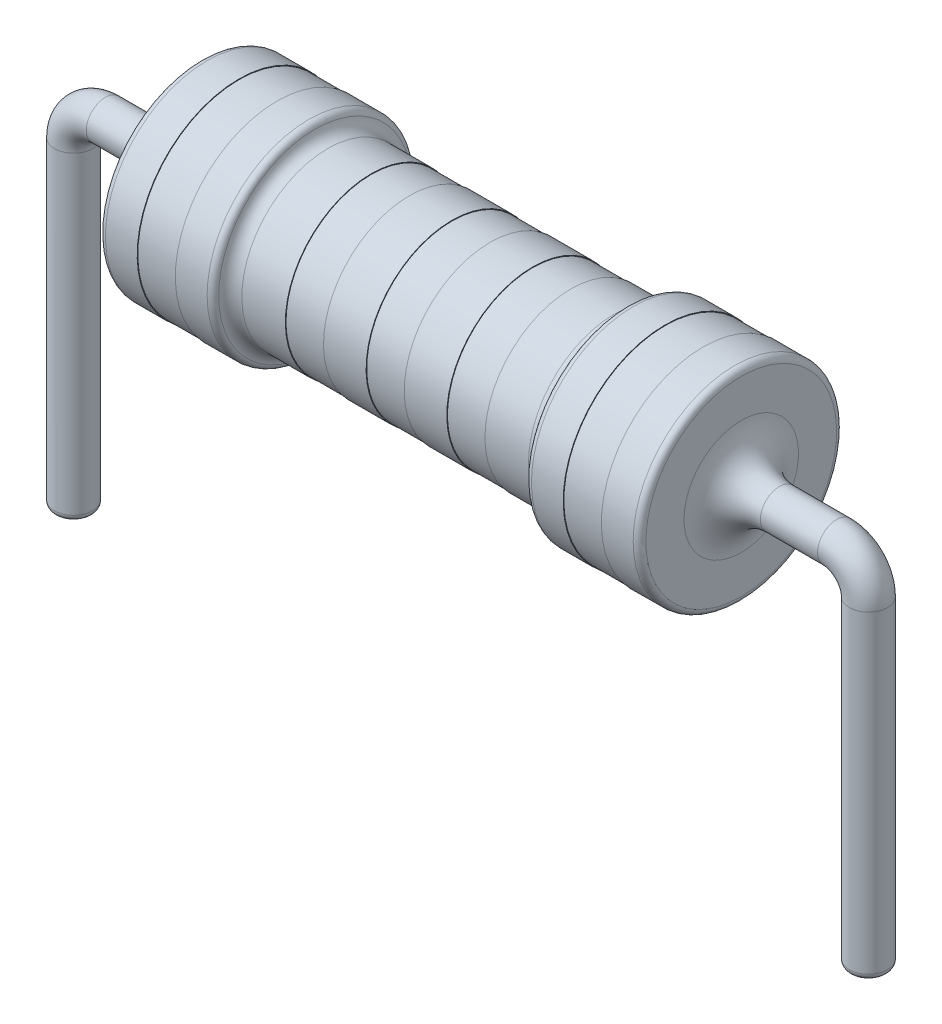
ISO-10303-21;
HEADER;
FILE_DESCRIPTION(('STEP AP214'),'2;1');
FILE_NAME('part.step','',(''),(''),'','','');
FILE_SCHEMA(('AUTOMOTIVE_DESIGN { 1 0 10303 214 1 1 1 1 }'));
ENDSEC;
DATA;
#1=APPLICATION_CONTEXT('core data for automotive mechanical design processes');
#2=APPLICATION_PROTOCOL_DEFINITION('international standard','automotive_design',2000,#1);
#3=PRODUCT_CONTEXT('',#1,'mechanical');
#4=PRODUCT('Part','Part','',(#3));
#5=PRODUCT_RELATED_PRODUCT_CATEGORY('part','',(#4));
#6=PRODUCT_DEFINITION_FORMATION('','',#4);
#7=PRODUCT_DEFINITION_CONTEXT('part definition',#1,'design');
#8=PRODUCT_DEFINITION('design','',#6,#7);
#9=PRODUCT_DEFINITION_SHAPE('','',#8);
#10=(LENGTH_UNIT() NAMED_UNIT(*) SI_UNIT(.MILLI.,.METRE.));
#11=(NAMED_UNIT(*) PLANE_ANGLE_UNIT() SI_UNIT($,.RADIAN.));
#12=(NAMED_UNIT(*) SI_UNIT($,.STERADIAN.) SOLID_ANGLE_UNIT());
#13=UNCERTAINTY_MEASURE_WITH_UNIT(LENGTH_MEASURE(1.E-05),#10,'distance_accuracy_value','');
#14=(GEOMETRIC_REPRESENTATION_CONTEXT(3) GLOBAL_UNCERTAINTY_ASSIGNED_CONTEXT((#13)) GLOBAL_UNIT_ASSIGNED_CONTEXT((#10,
#11,#12)) REPRESENTATION_CONTEXT('',''));
#15=CARTESIAN_POINT('',(0.,0.,0.));
#16=DIRECTION('',(0.,0.,1.));
#17=DIRECTION('',(1.,0.,0.));
#18=AXIS2_PLACEMENT_3D('',#15,#16,#17);
#19=CARTESIAN_POINT('',(4.25,0.,0.));
#20=DIRECTION('',(-1.,0.,0.));
#21=DIRECTION('',(0.,-1.,0.));
#22=AXIS2_PLACEMENT_3D('',#19,#20,#21);
#23=PLANE('',#22);
#24=CARTESIAN_POINT('',(4.25,0.,0.));
#25=DIRECTION('',(-1.,0.,0.));
#26=DIRECTION('',(0.,-1.,0.));
#27=AXIS2_PLACEMENT_3D('',#24,#25,#26);
#28=CIRCLE('',#27,0.9);
#29=CARTESIAN_POINT('',(4.25,-0.899999999999984,0.));
#30=VERTEX_POINT('',#29);
#31=EDGE_CURVE('E54',#30,#30,#28,.T.);
#32=ORIENTED_EDGE('',*,*,#31,.T.);
#33=EDGE_LOOP('',(#32));
#34=FACE_BOUND('',#33,.T.);
#35=CARTESIAN_POINT('',(4.25,0.,0.));
#36=DIRECTION('',(-1.,0.,0.));
#37=DIRECTION('',(0.,-1.,0.));
#38=AXIS2_PLACEMENT_3D('',#35,#36,#37);
#39=CIRCLE('',#38,1.5);
#40=CARTESIAN_POINT('',(4.25000000000001,-1.5,0.));
#41=VERTEX_POINT('',#40);
#42=EDGE_CURVE('E87',#41,#41,#39,.F.);
#43=ORIENTED_EDGE('',*,*,#42,.T.);
#44=EDGE_LOOP('',(#43));
#45=FACE_BOUND('',#44,.T.);
#46=ADVANCED_FACE('F34',(#34,#45),#23,.F.);
#47=CARTESIAN_POINT('',(4.25,0.,0.));
#48=DIRECTION('',(1.,0.,0.));
#49=DIRECTION('',(0.,1.,0.));
#50=AXIS2_PLACEMENT_3D('',#47,#48,#49);
#51=CYLINDRICAL_SURFACE('',#50,1.33999999999997);
#52=CARTESIAN_POINT('',(0.299999999999991,0.,0.));
#53=DIRECTION('',(1.,0.,0.));
#54=DIRECTION('',(0.,1.,0.));
#55=AXIS2_PLACEMENT_3D('',#52,#53,#54);
#56=CIRCLE('',#55,1.33999999999997);
#57=CARTESIAN_POINT('',(0.299999999999982,1.33999999999995,0.));
#58=VERTEX_POINT('',#57);
#59=EDGE_CURVE('E153',#58,#58,#56,.T.);
#60=ORIENTED_EDGE('',*,*,#59,.F.);
#61=EDGE_LOOP('',(#60));
#62=FACE_BOUND('',#61,.T.);
#63=CARTESIAN_POINT('',(-0.299999999999991,0.,0.));
#64=DIRECTION('',(1.,0.,0.));
#65=DIRECTION('',(0.,1.,0.));
#66=AXIS2_PLACEMENT_3D('',#63,#64,#65);
#67=CIRCLE('',#66,1.33999999999997);
#68=CARTESIAN_POINT('',(-0.3,1.33999999999994,0.));
#69=VERTEX_POINT('',#68);
#70=EDGE_CURVE('E96',#69,#69,#67,.T.);
#71=ORIENTED_EDGE('',*,*,#70,.T.);
#72=EDGE_LOOP('',(#71));
#73=FACE_BOUND('',#72,.T.);
#74=ADVANCED_FACE('F188',(#62,#73),#51,.T.);
#75=CARTESIAN_POINT('',(-0.299999999999982,-1.34,0.));
#76=DIRECTION('',(-1.,0.,0.));
#77=DIRECTION('',(0.,-1.,0.));
#78=AXIS2_PLACEMENT_3D('',#75,#76,#77);
#79=PLANE('',#78);
#80=ORIENTED_EDGE('',*,*,#70,.F.);
#81=EDGE_LOOP('',(#80));
#82=FACE_BOUND('',#81,.T.);
#83=CARTESIAN_POINT('',(-0.299999999999991,0.,0.));
#84=DIRECTION('',(1.,0.,0.));
#85=DIRECTION('',(0.,1.,0.));
#86=AXIS2_PLACEMENT_3D('',#83,#84,#85);
#87=CIRCLE('',#86,1.34999999999997);
#88=CARTESIAN_POINT('',(-0.3,1.34999999999994,0.));
#89=VERTEX_POINT('',#88);
#90=EDGE_CURVE('E99',#89,#89,#87,.T.);
#91=ORIENTED_EDGE('',*,*,#90,.T.);
#92=EDGE_LOOP('',(#91));
#93=FACE_BOUND('',#92,.T.);
#94=ADVANCED_FACE('F194',(#82,#93),#79,.F.);
#95=CARTESIAN_POINT('',(4.25,0.,0.));
#96=DIRECTION('',(1.,0.,0.));
#97=DIRECTION('',(0.,1.,0.));
#98=AXIS2_PLACEMENT_3D('',#95,#96,#97);
#99=CYLINDRICAL_SURFACE('',#98,1.34999999999998);
#100=ORIENTED_EDGE('',*,*,#90,.F.);
#101=EDGE_LOOP('',(#100));
#102=FACE_BOUND('',#101,.T.);
#103=CARTESIAN_POINT('',(-0.969520407326291,0.,0.));
#104=DIRECTION('',(1.,0.,0.));
#105=DIRECTION('',(0.,1.,0.));
#106=AXIS2_PLACEMENT_3D('',#103,#104,#105);
#107=CIRCLE('',#106,1.34999999999998);
#108=CARTESIAN_POINT('',(-0.9695204073263,1.34999999999994,0.));
#109=VERTEX_POINT('',#108);
#110=EDGE_CURVE('E102',#109,#109,#107,.T.);
#111=ORIENTED_EDGE('',*,*,#110,.T.);
#112=EDGE_LOOP('',(#111));
#113=FACE_BOUND('',#112,.T.);
#114=ADVANCED_FACE('F241',(#102,#113),#99,.T.);
#115=CARTESIAN_POINT('',(-0.969520407326283,-1.34000000000001,0.));
#116=DIRECTION('',(1.,0.,0.));
#117=DIRECTION('',(0.,1.,0.));
#118=AXIS2_PLACEMENT_3D('',#115,#116,#117);
#119=PLANE('',#118);
#120=ORIENTED_EDGE('',*,*,#110,.F.);
#121=EDGE_LOOP('',(#120));
#122=FACE_BOUND('',#121,.T.);
#123=CARTESIAN_POINT('',(-0.969520407326291,0.,0.));
#124=DIRECTION('',(1.,0.,0.));
#125=DIRECTION('',(0.,1.,0.));
#126=AXIS2_PLACEMENT_3D('',#123,#124,#125);
#127=CIRCLE('',#126,1.33999999999998);
#128=CARTESIAN_POINT('',(-0.9695204073263,1.33999999999994,0.));
#129=VERTEX_POINT('',#128);
#130=EDGE_CURVE('E105',#129,#129,#127,.T.);
#131=ORIENTED_EDGE('',*,*,#130,.T.);
#132=EDGE_LOOP('',(#131));
#133=FACE_BOUND('',#132,.T.);
#134=ADVANCED_FACE('F237',(#122,#133),#119,.F.);
#135=CARTESIAN_POINT('',(4.25,0.,0.));
#136=DIRECTION('',(1.,0.,0.));
#137=DIRECTION('',(0.,1.,0.));
#138=AXIS2_PLACEMENT_3D('',#135,#136,#137);
#139=CYLINDRICAL_SURFACE('',#138,1.33999999999998);
#140=ORIENTED_EDGE('',*,*,#130,.F.);
#141=EDGE_LOOP('',(#140));
#142=FACE_BOUND('',#141,.T.);
#143=CARTESIAN_POINT('',(-1.56952040732629,0.,0.));
#144=DIRECTION('',(1.,0.,0.));
#145=DIRECTION('',(0.,1.,0.));
#146=AXIS2_PLACEMENT_3D('',#143,#144,#145);
#147=CIRCLE('',#146,1.33999999999998);
#148=CARTESIAN_POINT('',(-1.5695204073263,1.33999999999994,0.));
#149=VERTEX_POINT('',#148);
#150=EDGE_CURVE('E108',#149,#149,#147,.T.);
#151=ORIENTED_EDGE('',*,*,#150,.T.);
#152=EDGE_LOOP('',(#151));
#153=FACE_BOUND('',#152,.T.);
#154=ADVANCED_FACE('F233',(#142,#153),#139,.T.);
#155=CARTESIAN_POINT('',(-1.56952040732628,-1.35000000000002,0.));
#156=DIRECTION('',(-1.,0.,0.));
#157=DIRECTION('',(0.,-1.,0.));
#158=AXIS2_PLACEMENT_3D('',#155,#156,#157);
#159=PLANE('',#158);
#160=ORIENTED_EDGE('',*,*,#150,.F.);
#161=EDGE_LOOP('',(#160));
#162=FACE_BOUND('',#161,.T.);
#163=CARTESIAN_POINT('',(-1.56952040732629,0.,0.));
#164=DIRECTION('',(1.,0.,0.));
#165=DIRECTION('',(0.,1.,0.));
#166=AXIS2_PLACEMENT_3D('',#163,#164,#165);
#167=CIRCLE('',#166,1.34999999999998);
#168=CARTESIAN_POINT('',(-1.5695204073263,1.34999999999994,0.));
#169=VERTEX_POINT('',#168);
#170=EDGE_CURVE('E111',#169,#169,#167,.T.);
#171=ORIENTED_EDGE('',*,*,#170,.T.);
#172=EDGE_LOOP('',(#171));
#173=FACE_BOUND('',#172,.T.);
#174=ADVANCED_FACE('F229',(#162,#173),#159,.F.);
#175=CARTESIAN_POINT('',(4.25,0.,0.));
#176=DIRECTION('',(1.,0.,0.));
#177=DIRECTION('',(0.,1.,0.));
#178=AXIS2_PLACEMENT_3D('',#175,#176,#177);
#179=CYLINDRICAL_SURFACE('',#178,1.34999999999999);
#180=CARTESIAN_POINT('',(-2.25419601084501,0.,0.));
#181=DIRECTION('',(1.,0.,0.));
#182=DIRECTION('',(0.,1.,0.));
#183=AXIS2_PLACEMENT_3D('',#180,#181,#182);
#184=CIRCLE('',#183,1.34999999999999);
#185=CARTESIAN_POINT('',(-2.25419601084502,1.34999999999994,0.));
#186=VERTEX_POINT('',#185);
#187=EDGE_CURVE('E69',#186,#186,#184,.T.);
#188=ORIENTED_EDGE('',*,*,#187,.T.);
#189=EDGE_LOOP('',(#188));
#190=FACE_BOUND('',#189,.T.);
#191=ORIENTED_EDGE('',*,*,#170,.F.);
#192=EDGE_LOOP('',(#191));
#193=FACE_BOUND('',#192,.T.);
#194=ADVANCED_FACE('F225',(#190,#193),#179,.T.);
#195=CARTESIAN_POINT('',(4.25,0.,0.));
#196=DIRECTION('',(1.,0.,0.));
#197=DIRECTION('',(0.,1.,0.));
#198=AXIS2_PLACEMENT_3D('',#195,#196,#197);
#199=CYLINDRICAL_SURFACE('',#198,1.59999999999999);
#200=CARTESIAN_POINT('',(-2.54999999999999,0.,0.));
#201=DIRECTION('',(-1.,0.,0.));
#202=DIRECTION('',(0.,-1.,0.));
#203=AXIS2_PLACEMENT_3D('',#200,#201,#202);
#204=CIRCLE('',#203,1.59999999999999);
#205=CARTESIAN_POINT('',(-2.54999999999998,-1.60000000000003,0.));
#206=VERTEX_POINT('',#205);
#207=EDGE_CURVE('E90',#206,#206,#204,.T.);
#208=ORIENTED_EDGE('',*,*,#207,.T.);
#209=EDGE_LOOP('',(#208));
#210=FACE_BOUND('',#209,.T.);
#211=CARTESIAN_POINT('',(-3.04999999999999,0.,0.));
#212=DIRECTION('',(1.,0.,0.));
#213=DIRECTION('',(0.,1.,0.));
#214=AXIS2_PLACEMENT_3D('',#211,#212,#213);
#215=CIRCLE('',#214,1.59999999999999);
#216=CARTESIAN_POINT('',(-3.05,1.59999999999994,0.));
#217=VERTEX_POINT('',#216);
#218=EDGE_CURVE('E114',#217,#217,#215,.T.);
#219=ORIENTED_EDGE('',*,*,#218,.T.);
#220=EDGE_LOOP('',(#219));
#221=FACE_BOUND('',#220,.T.);
#222=ADVANCED_FACE('F221',(#210,#221),#199,.T.);
#223=CARTESIAN_POINT('',(-3.04999999999998,-1.59000000000004,0.));
#224=DIRECTION('',(1.,0.,0.));
#225=DIRECTION('',(0.,1.,0.));
#226=AXIS2_PLACEMENT_3D('',#223,#224,#225);
#227=PLANE('',#226);
#228=ORIENTED_EDGE('',*,*,#218,.F.);
#229=EDGE_LOOP('',(#228));
#230=FACE_BOUND('',#229,.T.);
#231=CARTESIAN_POINT('',(-3.04999999999999,0.,0.));
#232=DIRECTION('',(1.,0.,0.));
#233=DIRECTION('',(0.,1.,0.));
#234=AXIS2_PLACEMENT_3D('',#231,#232,#233);
#235=CIRCLE('',#234,1.58999999999999);
#236=CARTESIAN_POINT('',(-3.05,1.58999999999994,0.));
#237=VERTEX_POINT('',#236);
#238=EDGE_CURVE('E117',#237,#237,#235,.T.);
#239=ORIENTED_EDGE('',*,*,#238,.T.);
#240=EDGE_LOOP('',(#239));
#241=FACE_BOUND('',#240,.T.);
#242=ADVANCED_FACE('F217',(#230,#241),#227,.F.);
#243=CARTESIAN_POINT('',(4.25,0.,0.));
#244=DIRECTION('',(1.,0.,0.));
#245=DIRECTION('',(0.,1.,0.));
#246=AXIS2_PLACEMENT_3D('',#243,#244,#245);
#247=CYLINDRICAL_SURFACE('',#246,1.58999999999999);
#248=ORIENTED_EDGE('',*,*,#238,.F.);
#249=EDGE_LOOP('',(#248));
#250=FACE_BOUND('',#249,.T.);
#251=CARTESIAN_POINT('',(-3.64999999999999,0.,0.));
#252=DIRECTION('',(1.,0.,0.));
#253=DIRECTION('',(0.,1.,0.));
#254=AXIS2_PLACEMENT_3D('',#251,#252,#253);
#255=CIRCLE('',#254,1.59);
#256=CARTESIAN_POINT('',(-3.65,1.58999999999994,0.));
#257=VERTEX_POINT('',#256);
#258=EDGE_CURVE('E120',#257,#257,#255,.T.);
#259=ORIENTED_EDGE('',*,*,#258,.T.);
#260=EDGE_LOOP('',(#259));
#261=FACE_BOUND('',#260,.T.);
#262=ADVANCED_FACE('F213',(#250,#261),#247,.T.);
#263=CARTESIAN_POINT('',(-3.64999999999998,-1.60000000000005,0.));
#264=DIRECTION('',(-1.,0.,0.));
#265=DIRECTION('',(0.,-1.,0.));
#266=AXIS2_PLACEMENT_3D('',#263,#264,#265);
#267=PLANE('',#266);
#268=ORIENTED_EDGE('',*,*,#258,.F.);
#269=EDGE_LOOP('',(#268));
#270=FACE_BOUND('',#269,.T.);
#271=CARTESIAN_POINT('',(-3.64999999999999,0.,0.));
#272=DIRECTION('',(1.,0.,0.));
#273=DIRECTION('',(0.,1.,0.));
#274=AXIS2_PLACEMENT_3D('',#271,#272,#273);
#275=CIRCLE('',#274,1.6);
#276=CARTESIAN_POINT('',(-3.65,1.59999999999994,0.));
#277=VERTEX_POINT('',#276);
#278=EDGE_CURVE('E123',#277,#277,#275,.T.);
#279=ORIENTED_EDGE('',*,*,#278,.T.);
#280=EDGE_LOOP('',(#279));
#281=FACE_BOUND('',#280,.T.);
#282=ADVANCED_FACE('F209',(#270,#281),#267,.F.);
#283=CARTESIAN_POINT('',(4.25,0.,0.));
#284=DIRECTION('',(1.,0.,0.));
#285=DIRECTION('',(0.,1.,0.));
#286=AXIS2_PLACEMENT_3D('',#283,#284,#285);
#287=CYLINDRICAL_SURFACE('',#286,1.6);
#288=CARTESIAN_POINT('',(-4.15,0.,0.));
#289=DIRECTION('',(1.,0.,0.));
#290=DIRECTION('',(0.,1.,0.));
#291=AXIS2_PLACEMENT_3D('',#288,#289,#290);
#292=CIRCLE('',#291,1.6);
#293=CARTESIAN_POINT('',(-4.15000000000001,1.59999999999994,0.));
#294=VERTEX_POINT('',#293);
#295=EDGE_CURVE('E81',#294,#294,#292,.T.);
#296=ORIENTED_EDGE('',*,*,#295,.T.);
#297=EDGE_LOOP('',(#296));
#298=FACE_BOUND('',#297,.T.);
#299=ORIENTED_EDGE('',*,*,#278,.F.);
#300=EDGE_LOOP('',(#299));
#301=FACE_BOUND('',#300,.T.);
#302=ADVANCED_FACE('F205',(#298,#301),#287,.T.);
#303=CARTESIAN_POINT('',(-4.25,0.,0.));
#304=DIRECTION('',(1.,0.,0.));
#305=DIRECTION('',(0.,1.,0.));
#306=AXIS2_PLACEMENT_3D('',#303,#304,#305);
#307=PLANE('',#306);
#308=CARTESIAN_POINT('',(-4.25,0.,0.));
#309=DIRECTION('',(1.,0.,0.));
#310=DIRECTION('',(0.,1.,0.));
#311=AXIS2_PLACEMENT_3D('',#308,#309,#310);
#312=CIRCLE('',#311,0.9);
#313=CARTESIAN_POINT('',(-4.25,0.900000000000023,0.));
#314=VERTEX_POINT('',#313);
#315=EDGE_CURVE('E63',#314,#314,#312,.T.);
#316=ORIENTED_EDGE('',*,*,#315,.T.);
#317=EDGE_LOOP('',(#316));
#318=FACE_BOUND('',#317,.T.);
#319=CARTESIAN_POINT('',(-4.25,0.,0.));
#320=DIRECTION('',(1.,0.,0.));
#321=DIRECTION('',(0.,1.,0.));
#322=AXIS2_PLACEMENT_3D('',#319,#320,#321);
#323=CIRCLE('',#322,1.5);
#324=CARTESIAN_POINT('',(-4.25000000000001,1.49999999999994,0.));
#325=VERTEX_POINT('',#324);
#326=EDGE_CURVE('E78',#325,#325,#323,.F.);
#327=ORIENTED_EDGE('',*,*,#326,.T.);
#328=EDGE_LOOP('',(#327));
#329=FACE_BOUND('',#328,.T.);
#330=ADVANCED_FACE('F202',(#318,#329),#307,.F.);
#331=CARTESIAN_POINT('',(4.25,0.,0.));
#332=DIRECTION('',(1.,0.,0.));
#333=DIRECTION('',(0.,1.,0.));
#334=AXIS2_PLACEMENT_3D('',#331,#332,#333);
#335=CYLINDRICAL_SURFACE('',#334,1.6);
#336=CARTESIAN_POINT('',(4.15,0.,0.));
#337=DIRECTION('',(-1.,0.,0.));
#338=DIRECTION('',(0.,-1.,0.));
#339=AXIS2_PLACEMENT_3D('',#336,#337,#338);
#340=CIRCLE('',#339,1.6);
#341=CARTESIAN_POINT('',(4.15000000000001,-1.6,0.));
#342=VERTEX_POINT('',#341);
#343=EDGE_CURVE('E84',#342,#342,#340,.T.);
#344=ORIENTED_EDGE('',*,*,#343,.T.);
#345=EDGE_LOOP('',(#344));
#346=FACE_BOUND('',#345,.T.);
#347=CARTESIAN_POINT('',(3.64999999999999,0.,0.));
#348=DIRECTION('',(1.,0.,0.));
#349=DIRECTION('',(0.,1.,0.));
#350=AXIS2_PLACEMENT_3D('',#347,#348,#349);
#351=CIRCLE('',#350,1.6);
#352=CARTESIAN_POINT('',(3.64999999999998,1.59999999999999,0.));
#353=VERTEX_POINT('',#352);
#354=EDGE_CURVE('E126',#353,#353,#351,.T.);
#355=ORIENTED_EDGE('',*,*,#354,.T.);
#356=EDGE_LOOP('',(#355));
#357=FACE_BOUND('',#356,.T.);
#358=ADVANCED_FACE('F200',(#346,#357),#335,.T.);
#359=CARTESIAN_POINT('',(3.65,-1.6,0.));
#360=DIRECTION('',(1.,0.,0.));
#361=DIRECTION('',(0.,1.,0.));
#362=AXIS2_PLACEMENT_3D('',#359,#360,#361);
#363=PLANE('',#362);
#364=ORIENTED_EDGE('',*,*,#354,.F.);
#365=EDGE_LOOP('',(#364));
#366=FACE_BOUND('',#365,.T.);
#367=CARTESIAN_POINT('',(3.64999999999999,0.,0.));
#368=DIRECTION('',(1.,0.,0.));
#369=DIRECTION('',(0.,1.,0.));
#370=AXIS2_PLACEMENT_3D('',#367,#368,#369);
#371=CIRCLE('',#370,1.59);
#372=CARTESIAN_POINT('',(3.64999999999998,1.58999999999999,0.));
#373=VERTEX_POINT('',#372);
#374=EDGE_CURVE('E129',#373,#373,#371,.T.);
#375=ORIENTED_EDGE('',*,*,#374,.T.);
#376=EDGE_LOOP('',(#375));
#377=FACE_BOUND('',#376,.T.);
#378=ADVANCED_FACE('F342',(#366,#377),#363,.F.);
#379=CARTESIAN_POINT('',(4.25,0.,0.));
#380=DIRECTION('',(1.,0.,0.));
#381=DIRECTION('',(0.,1.,0.));
#382=AXIS2_PLACEMENT_3D('',#379,#380,#381);
#383=CYLINDRICAL_SURFACE('',#382,1.58999999999999);
#384=ORIENTED_EDGE('',*,*,#374,.F.);
#385=EDGE_LOOP('',(#384));
#386=FACE_BOUND('',#385,.T.);
#387=CARTESIAN_POINT('',(3.04999999999999,0.,0.));
#388=DIRECTION('',(1.,0.,0.));
#389=DIRECTION('',(0.,1.,0.));
#390=AXIS2_PLACEMENT_3D('',#387,#388,#389);
#391=CIRCLE('',#390,1.58999999999999);
#392=CARTESIAN_POINT('',(3.04999999999998,1.58999999999998,0.));
#393=VERTEX_POINT('',#392);
#394=EDGE_CURVE('E132',#393,#393,#391,.T.);
#395=ORIENTED_EDGE('',*,*,#394,.T.);
#396=EDGE_LOOP('',(#395));
#397=FACE_BOUND('',#396,.T.);
#398=ADVANCED_FACE('F339',(#386,#397),#383,.T.);
#399=CARTESIAN_POINT('',(3.05,-1.59,0.));
#400=DIRECTION('',(-1.,0.,0.));
#401=DIRECTION('',(0.,-1.,0.));
#402=AXIS2_PLACEMENT_3D('',#399,#400,#401);
#403=PLANE('',#402);
#404=ORIENTED_EDGE('',*,*,#394,.F.);
#405=EDGE_LOOP('',(#404));
#406=FACE_BOUND('',#405,.T.);
#407=CARTESIAN_POINT('',(3.04999999999999,0.,0.));
#408=DIRECTION('',(1.,0.,0.));
#409=DIRECTION('',(0.,1.,0.));
#410=AXIS2_PLACEMENT_3D('',#407,#408,#409);
#411=CIRCLE('',#410,1.59999999999999);
#412=CARTESIAN_POINT('',(3.04999999999998,1.59999999999999,0.));
#413=VERTEX_POINT('',#412);
#414=EDGE_CURVE('E135',#413,#413,#411,.T.);
#415=ORIENTED_EDGE('',*,*,#414,.T.);
#416=EDGE_LOOP('',(#415));
#417=FACE_BOUND('',#416,.T.);
#418=ADVANCED_FACE('F335',(#406,#417),#403,.F.);
#419=CARTESIAN_POINT('',(4.25,0.,0.));
#420=DIRECTION('',(1.,0.,0.));
#421=DIRECTION('',(0.,1.,0.));
#422=AXIS2_PLACEMENT_3D('',#419,#420,#421);
#423=CYLINDRICAL_SURFACE('',#422,1.59999999999999);
#424=CARTESIAN_POINT('',(2.54999999999999,0.,0.));
#425=DIRECTION('',(1.,0.,0.));
#426=DIRECTION('',(0.,1.,0.));
#427=AXIS2_PLACEMENT_3D('',#424,#425,#426);
#428=CIRCLE('',#427,1.59999999999999);
#429=CARTESIAN_POINT('',(2.54999999999998,1.59999999999998,0.));
#430=VERTEX_POINT('',#429);
#431=EDGE_CURVE('E93',#430,#430,#428,.T.);
#432=ORIENTED_EDGE('',*,*,#431,.T.);
#433=EDGE_LOOP('',(#432));
#434=FACE_BOUND('',#433,.T.);
#435=ORIENTED_EDGE('',*,*,#414,.F.);
#436=EDGE_LOOP('',(#435));
#437=FACE_BOUND('',#436,.T.);
#438=ADVANCED_FACE('F331',(#434,#437),#423,.T.);
#439=CARTESIAN_POINT('',(4.25,0.,0.));
#440=DIRECTION('',(1.,0.,0.));
#441=DIRECTION('',(0.,1.,0.));
#442=AXIS2_PLACEMENT_3D('',#439,#440,#441);
#443=CYLINDRICAL_SURFACE('',#442,1.34999999999999);
#444=CARTESIAN_POINT('',(2.25419601084501,0.,0.));
#445=DIRECTION('',(1.,0.,0.));
#446=DIRECTION('',(0.,1.,0.));
#447=AXIS2_PLACEMENT_3D('',#444,#445,#446);
#448=CIRCLE('',#447,1.34999999999999);
#449=CARTESIAN_POINT('',(2.254196010845,1.34999999999997,0.));
#450=VERTEX_POINT('',#449);
#451=EDGE_CURVE('E72',#450,#450,#448,.F.);
#452=ORIENTED_EDGE('',*,*,#451,.T.);
#453=EDGE_LOOP('',(#452));
#454=FACE_BOUND('',#453,.T.);
#455=CARTESIAN_POINT('',(1.56952040732629,0.,0.));
#456=DIRECTION('',(1.,0.,0.));
#457=DIRECTION('',(0.,1.,0.));
#458=AXIS2_PLACEMENT_3D('',#455,#456,#457);
#459=CIRCLE('',#458,1.34999999999998);
#460=CARTESIAN_POINT('',(1.56952040732628,1.34999999999997,0.));
#461=VERTEX_POINT('',#460);
#462=EDGE_CURVE('E138',#461,#461,#459,.T.);
#463=ORIENTED_EDGE('',*,*,#462,.T.);
#464=EDGE_LOOP('',(#463));
#465=FACE_BOUND('',#464,.T.);
#466=ADVANCED_FACE('F327',(#454,#465),#443,.T.);
#467=CARTESIAN_POINT('',(1.5695204073263,-1.35,0.));
#468=DIRECTION('',(1.,0.,0.));
#469=DIRECTION('',(0.,1.,0.));
#470=AXIS2_PLACEMENT_3D('',#467,#468,#469);
#471=PLANE('',#470);
#472=ORIENTED_EDGE('',*,*,#462,.F.);
#473=EDGE_LOOP('',(#472));
#474=FACE_BOUND('',#473,.T.);
#475=CARTESIAN_POINT('',(1.56952040732629,0.,0.));
#476=DIRECTION('',(1.,0.,0.));
#477=DIRECTION('',(0.,1.,0.));
#478=AXIS2_PLACEMENT_3D('',#475,#476,#477);
#479=CIRCLE('',#478,1.33999999999998);
#480=CARTESIAN_POINT('',(1.56952040732628,1.33999999999996,0.));
#481=VERTEX_POINT('',#480);
#482=EDGE_CURVE('E141',#481,#481,#479,.T.);
#483=ORIENTED_EDGE('',*,*,#482,.T.);
#484=EDGE_LOOP('',(#483));
#485=FACE_BOUND('',#484,.T.);
#486=ADVANCED_FACE('F323',(#474,#485),#471,.F.);
#487=CARTESIAN_POINT('',(4.25,0.,0.));
#488=DIRECTION('',(1.,0.,0.));
#489=DIRECTION('',(0.,1.,0.));
#490=AXIS2_PLACEMENT_3D('',#487,#488,#489);
#491=CYLINDRICAL_SURFACE('',#490,1.33999999999998);
#492=ORIENTED_EDGE('',*,*,#482,.F.);
#493=EDGE_LOOP('',(#492));
#494=FACE_BOUND('',#493,.T.);
#495=CARTESIAN_POINT('',(0.969520407326292,0.,0.));
#496=DIRECTION('',(1.,0.,0.));
#497=DIRECTION('',(0.,1.,0.));
#498=AXIS2_PLACEMENT_3D('',#495,#496,#497);
#499=CIRCLE('',#498,1.33999999999998);
#500=CARTESIAN_POINT('',(0.969520407326283,1.33999999999996,0.));
#501=VERTEX_POINT('',#500);
#502=EDGE_CURVE('E144',#501,#501,#499,.T.);
#503=ORIENTED_EDGE('',*,*,#502,.T.);
#504=EDGE_LOOP('',(#503));
#505=FACE_BOUND('',#504,.T.);
#506=ADVANCED_FACE('F319',(#494,#505),#491,.T.);
#507=CARTESIAN_POINT('',(0.969520407326301,-1.34,0.));
#508=DIRECTION('',(-1.,0.,0.));
#509=DIRECTION('',(0.,-1.,0.));
#510=AXIS2_PLACEMENT_3D('',#507,#508,#509);
#511=PLANE('',#510);
#512=ORIENTED_EDGE('',*,*,#502,.F.);
#513=EDGE_LOOP('',(#512));
#514=FACE_BOUND('',#513,.T.);
#515=CARTESIAN_POINT('',(0.969520407326291,0.,0.));
#516=DIRECTION('',(1.,0.,0.));
#517=DIRECTION('',(0.,1.,0.));
#518=AXIS2_PLACEMENT_3D('',#515,#516,#517);
#519=CIRCLE('',#518,1.34999999999998);
#520=CARTESIAN_POINT('',(0.969520407326283,1.34999999999996,0.));
#521=VERTEX_POINT('',#520);
#522=EDGE_CURVE('E147',#521,#521,#519,.T.);
#523=ORIENTED_EDGE('',*,*,#522,.T.);
#524=EDGE_LOOP('',(#523));
#525=FACE_BOUND('',#524,.T.);
#526=ADVANCED_FACE('F315',(#514,#525),#511,.F.);
#527=CARTESIAN_POINT('',(4.25,0.,0.));
#528=DIRECTION('',(1.,0.,0.));
#529=DIRECTION('',(0.,1.,0.));
#530=AXIS2_PLACEMENT_3D('',#527,#528,#529);
#531=CYLINDRICAL_SURFACE('',#530,1.34999999999998);
#532=ORIENTED_EDGE('',*,*,#522,.F.);
#533=EDGE_LOOP('',(#532));
#534=FACE_BOUND('',#533,.T.);
#535=CARTESIAN_POINT('',(0.299999999999991,0.,0.));
#536=DIRECTION('',(1.,0.,0.));
#537=DIRECTION('',(0.,1.,0.));
#538=AXIS2_PLACEMENT_3D('',#535,#536,#537);
#539=CIRCLE('',#538,1.34999999999997);
#540=CARTESIAN_POINT('',(0.299999999999982,1.34999999999995,0.));
#541=VERTEX_POINT('',#540);
#542=EDGE_CURVE('E150',#541,#541,#539,.T.);
#543=ORIENTED_EDGE('',*,*,#542,.T.);
#544=EDGE_LOOP('',(#543));
#545=FACE_BOUND('',#544,.T.);
#546=ADVANCED_FACE('F311',(#534,#545),#531,.T.);
#547=CARTESIAN_POINT('',(0.3,-1.34,0.));
#548=DIRECTION('',(1.,0.,0.));
#549=DIRECTION('',(0.,1.,0.));
#550=AXIS2_PLACEMENT_3D('',#547,#548,#549);
#551=PLANE('',#550);
#552=ORIENTED_EDGE('',*,*,#542,.F.);
#553=EDGE_LOOP('',(#552));
#554=FACE_BOUND('',#553,.T.);
#555=ORIENTED_EDGE('',*,*,#59,.T.);
#556=EDGE_LOOP('',(#555));
#557=FACE_BOUND('',#556,.T.);
#558=ADVANCED_FACE('F296',(#554,#557),#551,.F.);
#559=CARTESIAN_POINT('',(6.25,-0.499999999999994,0.));
#560=DIRECTION('',(0.,-1.,0.));
#561=DIRECTION('',(0.,0.,-1.));
#562=AXIS2_PLACEMENT_3D('',#559,#560,#561);
#563=CYLINDRICAL_SURFACE('',#562,0.3);
#564=CARTESIAN_POINT('',(6.25,-5.43084259207682,0.));
#565=DIRECTION('',(0.,-1.,0.));
#566=DIRECTION('',(1.,0.,0.));
#567=AXIS2_PLACEMENT_3D('',#564,#565,#566);
#568=CIRCLE('',#567,0.3);
#569=CARTESIAN_POINT('',(6.55,-5.43084259207681,0.));
#570=VERTEX_POINT('',#569);
#571=EDGE_CURVE('E45',#570,#570,#568,.F.);
#572=ORIENTED_EDGE('',*,*,#571,.T.);
#573=EDGE_LOOP('',(#572));
#574=FACE_BOUND('',#573,.T.);
#575=CARTESIAN_POINT('',(6.25,-0.499999999999994,0.));
#576=DIRECTION('',(0.,-1.,0.));
#577=DIRECTION('',(1.,0.,0.));
#578=AXIS2_PLACEMENT_3D('',#575,#576,#577);
#579=CIRCLE('',#578,0.3);
#580=CARTESIAN_POINT('',(6.55,-0.499999999999994,0.));
#581=VERTEX_POINT('',#580);
#582=EDGE_CURVE('E156',#581,#581,#579,.T.);
#583=ORIENTED_EDGE('',*,*,#582,.T.);
#584=EDGE_LOOP('',(#583));
#585=FACE_BOUND('',#584,.T.);
#586=ADVANCED_FACE('F292',(#574,#585),#563,.T.);
#587=CARTESIAN_POINT('',(5.75,-0.499999999999993,0.));
#588=DIRECTION('',(0.,0.,-1.));
#589=DIRECTION('',(-1.,0.,0.));
#590=AXIS2_PLACEMENT_3D('',#587,#588,#589);
#591=TOROIDAL_SURFACE('',#590,0.5,0.3);
#592=CARTESIAN_POINT('',(5.75,0.,0.));
#593=DIRECTION('',(1.,0.,0.));
#594=DIRECTION('',(0.,1.,0.));
#595=AXIS2_PLACEMENT_3D('',#592,#593,#594);
#596=CIRCLE('',#595,0.3);
#597=CARTESIAN_POINT('',(5.75000000000001,0.300000000000007,0.));
#598=VERTEX_POINT('',#597);
#599=EDGE_CURVE('E159',#598,#598,#596,.T.);
#600=CARTESIAN_POINT('',(5.75,-0.499999999999993,0.));
#601=DIRECTION('',(0.,0.,-1.));
#602=DIRECTION('',(-1.,0.,0.));
#603=AXIS2_PLACEMENT_3D('',#600,#601,#602);
#604=CIRCLE('',#603,0.8);
#605=EDGE_CURVE('',#598,#581,#604,.T.);
#606=ORIENTED_EDGE('',*,*,#599,.T.);
#607=ORIENTED_EDGE('',*,*,#582,.F.);
#608=ORIENTED_EDGE('',*,*,#605,.T.);
#609=ORIENTED_EDGE('',*,*,#605,.F.);
#610=EDGE_LOOP('',(#606,#608,#607,#609));
#611=FACE_BOUND('',#610,.T.);
#612=ADVANCED_FACE('F295',(#611),#591,.T.);
#613=CARTESIAN_POINT('',(5.75,0.,0.));
#614=DIRECTION('',(-1.,0.,0.));
#615=DIRECTION('',(0.,-1.,0.));
#616=AXIS2_PLACEMENT_3D('',#613,#614,#615);
#617=CYLINDRICAL_SURFACE('',#616,0.3);
#618=CARTESIAN_POINT('',(4.84999999999998,0.,0.));
#619=DIRECTION('',(-1.,0.,0.));
#620=DIRECTION('',(0.,-1.,0.));
#621=AXIS2_PLACEMENT_3D('',#618,#619,#620);
#622=CIRCLE('',#621,0.3);
#623=CARTESIAN_POINT('',(4.84999999999999,-0.29999999999998,0.));
#624=VERTEX_POINT('',#623);
#625=EDGE_CURVE('E57',#624,#624,#622,.F.);
#626=ORIENTED_EDGE('',*,*,#625,.T.);
#627=EDGE_LOOP('',(#626));
#628=FACE_BOUND('',#627,.T.);
#629=ORIENTED_EDGE('',*,*,#599,.F.);
#630=EDGE_LOOP('',(#629));
#631=FACE_BOUND('',#630,.T.);
#632=ADVANCED_FACE('F184',(#628,#631),#617,.T.);
#633=CARTESIAN_POINT('',(6.25,-5.53084259207682,0.));
#634=DIRECTION('',(0.,-1.,0.));
#635=DIRECTION('',(1.,0.,0.));
#636=AXIS2_PLACEMENT_3D('',#633,#634,#635);
#637=PLANE('',#636);
#638=CARTESIAN_POINT('',(6.25,-5.53084259207682,0.));
#639=DIRECTION('',(0.,-1.,0.));
#640=DIRECTION('',(1.,0.,0.));
#641=AXIS2_PLACEMENT_3D('',#638,#639,#640);
#642=CIRCLE('',#641,0.2);
#643=CARTESIAN_POINT('',(6.45,-5.53084259207681,0.));
#644=VERTEX_POINT('',#643);
#645=EDGE_CURVE('E49',#644,#644,#642,.T.);
#646=ORIENTED_EDGE('',*,*,#645,.T.);
#647=EDGE_LOOP('',(#646));
#648=FACE_BOUND('',#647,.T.);
#649=ADVANCED_FACE('F179',(#648),#637,.T.);
#650=CARTESIAN_POINT('',(-6.25,-0.499999999999994,0.));
#651=DIRECTION('',(0.,-1.,0.));
#652=DIRECTION('',(0.,0.,-1.));
#653=AXIS2_PLACEMENT_3D('',#650,#651,#652);
#654=CYLINDRICAL_SURFACE('',#653,0.3);
#655=CARTESIAN_POINT('',(-6.25,-5.43084259207682,0.));
#656=DIRECTION('',(0.,-1.,0.));
#657=DIRECTION('',(1.,0.,0.));
#658=AXIS2_PLACEMENT_3D('',#655,#656,#657);
#659=CIRCLE('',#658,0.3);
#660=CARTESIAN_POINT('',(-5.95,-5.43084259207683,0.));
#661=VERTEX_POINT('',#660);
#662=EDGE_CURVE('E41',#661,#661,#659,.F.);
#663=ORIENTED_EDGE('',*,*,#662,.T.);
#664=EDGE_LOOP('',(#663));
#665=FACE_BOUND('',#664,.T.);
#666=CARTESIAN_POINT('',(-6.25,-0.499999999999994,0.));
#667=DIRECTION('',(0.,1.,0.));
#668=DIRECTION('',(-1.,0.,0.));
#669=AXIS2_PLACEMENT_3D('',#666,#667,#668);
#670=CIRCLE('',#669,0.3);
#671=CARTESIAN_POINT('',(-6.55,-0.499999999999994,0.));
#672=VERTEX_POINT('',#671);
#673=EDGE_CURVE('E162',#672,#672,#670,.T.);
#674=ORIENTED_EDGE('',*,*,#673,.F.);
#675=EDGE_LOOP('',(#674));
#676=FACE_BOUND('',#675,.T.);
#677=ADVANCED_FACE('F174',(#665,#676),#654,.T.);
#678=CARTESIAN_POINT('',(-5.75,-0.499999999999993,0.));
#679=DIRECTION('',(0.,0.,1.));
#680=DIRECTION('',(1.,0.,0.));
#681=AXIS2_PLACEMENT_3D('',#678,#679,#680);
#682=TOROIDAL_SURFACE('',#681,0.5,0.3);
#683=CARTESIAN_POINT('',(-5.75,0.,0.));
#684=DIRECTION('',(1.,0.,0.));
#685=DIRECTION('',(0.,1.,0.));
#686=AXIS2_PLACEMENT_3D('',#683,#684,#685);
#687=CIRCLE('',#686,0.3);
#688=CARTESIAN_POINT('',(-5.75000000000001,0.300000000000007,0.));
#689=VERTEX_POINT('',#688);
#690=EDGE_CURVE('E165',#689,#689,#687,.T.);
#691=CARTESIAN_POINT('',(-5.75,-0.499999999999993,0.));
#692=DIRECTION('',(0.,0.,1.));
#693=DIRECTION('',(1.,0.,0.));
#694=AXIS2_PLACEMENT_3D('',#691,#692,#693);
#695=CIRCLE('',#694,0.8);
#696=EDGE_CURVE('',#689,#672,#695,.T.);
#697=ORIENTED_EDGE('',*,*,#690,.F.);
#698=ORIENTED_EDGE('',*,*,#673,.T.);
#699=ORIENTED_EDGE('',*,*,#696,.T.);
#700=ORIENTED_EDGE('',*,*,#696,.F.);
#701=EDGE_LOOP('',(#697,#699,#698,#700));
#702=FACE_BOUND('',#701,.T.);
#703=ADVANCED_FACE('F171',(#702),#682,.T.);
#704=CARTESIAN_POINT('',(-5.75,0.,0.));
#705=DIRECTION('',(1.,0.,0.));
#706=DIRECTION('',(0.,1.,0.));
#707=AXIS2_PLACEMENT_3D('',#704,#705,#706);
#708=CYLINDRICAL_SURFACE('',#707,0.3);
#709=CARTESIAN_POINT('',(-4.84999999999999,0.,0.));
#710=DIRECTION('',(1.,0.,0.));
#711=DIRECTION('',(0.,1.,0.));
#712=AXIS2_PLACEMENT_3D('',#709,#710,#711);
#713=CIRCLE('',#712,0.3);
#714=CARTESIAN_POINT('',(-4.84999999999999,0.30000000000002,0.));
#715=VERTEX_POINT('',#714);
#716=EDGE_CURVE('E60',#715,#715,#713,.F.);
#717=ORIENTED_EDGE('',*,*,#716,.T.);
#718=EDGE_LOOP('',(#717));
#719=FACE_BOUND('',#718,.T.);
#720=ORIENTED_EDGE('',*,*,#690,.T.);
#721=EDGE_LOOP('',(#720));
#722=FACE_BOUND('',#721,.T.);
#723=ADVANCED_FACE('F169',(#719,#722),#708,.T.);
#724=CARTESIAN_POINT('',(-6.25,-5.53084259207682,0.));
#725=DIRECTION('',(0.,-1.,0.));
#726=DIRECTION('',(-1.,0.,0.));
#727=AXIS2_PLACEMENT_3D('',#724,#725,#726);
#728=PLANE('',#727);
#729=CARTESIAN_POINT('',(-6.25,-5.53084259207682,0.));
#730=DIRECTION('',(0.,-1.,0.));
#731=DIRECTION('',(1.,0.,0.));
#732=AXIS2_PLACEMENT_3D('',#729,#730,#731);
#733=CIRCLE('',#732,0.2);
#734=CARTESIAN_POINT('',(-6.05,-5.53084259207682,0.));
#735=VERTEX_POINT('',#734);
#736=EDGE_CURVE('E10',#735,#735,#733,.T.);
#737=ORIENTED_EDGE('',*,*,#736,.T.);
#738=EDGE_LOOP('',(#737));
#739=FACE_BOUND('',#738,.T.);
#740=ADVANCED_FACE('F253',(#739),#728,.T.);
#741=CARTESIAN_POINT('',(2.54999999999999,0.,0.));
#742=DIRECTION('',(1.,0.,0.));
#743=DIRECTION('',(0.,1.,0.));
#744=AXIS2_PLACEMENT_3D('',#741,#742,#743);
#745=TOROIDAL_SURFACE('',#744,1.49999999999999,0.1);
#746=CARTESIAN_POINT('',(2.45139867028172,0.,0.));
#747=DIRECTION('',(1.,0.,0.));
#748=DIRECTION('',(0.,1.,0.));
#749=AXIS2_PLACEMENT_3D('',#746,#747,#748);
#750=CIRCLE('',#749,1.51666666666665);
#751=CARTESIAN_POINT('',(2.45139867028171,1.51666666666663,0.));
#752=VERTEX_POINT('',#751);
#753=EDGE_CURVE('E75',#752,#752,#750,.T.);
#754=ORIENTED_EDGE('',*,*,#753,.T.);
#755=EDGE_LOOP('',(#754));
#756=FACE_BOUND('',#755,.T.);
#757=ORIENTED_EDGE('',*,*,#431,.F.);
#758=EDGE_LOOP('',(#757));
#759=FACE_BOUND('',#758,.T.);
#760=ADVANCED_FACE('F249',(#756,#759),#745,.T.);
#761=CARTESIAN_POINT('',(-2.54999999999999,0.,0.));
#762=DIRECTION('',(-1.,0.,0.));
#763=DIRECTION('',(0.,-1.,0.));
#764=AXIS2_PLACEMENT_3D('',#761,#762,#763);
#765=TOROIDAL_SURFACE('',#764,1.49999999999999,0.1);
#766=CARTESIAN_POINT('',(-2.4513986702818,0.,0.));
#767=DIRECTION('',(-1.,0.,0.));
#768=DIRECTION('',(0.,-1.,0.));
#769=AXIS2_PLACEMENT_3D('',#766,#767,#768);
#770=CIRCLE('',#769,1.51666666666663);
#771=CARTESIAN_POINT('',(-2.45139867028179,-1.51666666666668,0.));
#772=VERTEX_POINT('',#771);
#773=EDGE_CURVE('E66',#772,#772,#770,.T.);
#774=ORIENTED_EDGE('',*,*,#773,.T.);
#775=EDGE_LOOP('',(#774));
#776=FACE_BOUND('',#775,.T.);
#777=ORIENTED_EDGE('',*,*,#207,.F.);
#778=EDGE_LOOP('',(#777));
#779=FACE_BOUND('',#778,.T.);
#780=ADVANCED_FACE('F252',(#776,#779),#765,.T.);
#781=CARTESIAN_POINT('',(4.15,0.,0.));
#782=DIRECTION('',(-1.,0.,0.));
#783=DIRECTION('',(0.,-1.,0.));
#784=AXIS2_PLACEMENT_3D('',#781,#782,#783);
#785=TOROIDAL_SURFACE('',#784,1.5,0.1);
#786=ORIENTED_EDGE('',*,*,#343,.F.);
#787=EDGE_LOOP('',(#786));
#788=FACE_BOUND('',#787,.T.);
#789=ORIENTED_EDGE('',*,*,#42,.F.);
#790=EDGE_LOOP('',(#789));
#791=FACE_BOUND('',#790,.T.);
#792=ADVANCED_FACE('F257',(#788,#791),#785,.T.);
#793=CARTESIAN_POINT('',(-4.15,0.,0.));
#794=DIRECTION('',(1.,0.,0.));
#795=DIRECTION('',(0.,1.,0.));
#796=AXIS2_PLACEMENT_3D('',#793,#794,#795);
#797=TOROIDAL_SURFACE('',#796,1.5,0.1);
#798=ORIENTED_EDGE('',*,*,#326,.F.);
#799=EDGE_LOOP('',(#798));
#800=FACE_BOUND('',#799,.T.);
#801=ORIENTED_EDGE('',*,*,#295,.F.);
#802=EDGE_LOOP('',(#801));
#803=FACE_BOUND('',#802,.T.);
#804=ADVANCED_FACE('F261',(#800,#803),#797,.T.);
#805=CARTESIAN_POINT('',(2.25419601084501,0.,0.));
#806=DIRECTION('',(1.,0.,0.));
#807=DIRECTION('',(0.,1.,0.));
#808=AXIS2_PLACEMENT_3D('',#805,#806,#807);
#809=TOROIDAL_SURFACE('',#808,1.54999999999999,0.2);
#810=ORIENTED_EDGE('',*,*,#451,.F.);
#811=EDGE_LOOP('',(#810));
#812=FACE_BOUND('',#811,.T.);
#813=ORIENTED_EDGE('',*,*,#753,.F.);
#814=EDGE_LOOP('',(#813));
#815=FACE_BOUND('',#814,.T.);
#816=ADVANCED_FACE('F265',(#812,#815),#809,.F.);
#817=CARTESIAN_POINT('',(-2.25419601084501,0.,0.));
#818=DIRECTION('',(1.,0.,0.));
#819=DIRECTION('',(0.,1.,0.));
#820=AXIS2_PLACEMENT_3D('',#817,#818,#819);
#821=TOROIDAL_SURFACE('',#820,1.54999999999999,0.2);
#822=ORIENTED_EDGE('',*,*,#773,.F.);
#823=EDGE_LOOP('',(#822));
#824=FACE_BOUND('',#823,.T.);
#825=ORIENTED_EDGE('',*,*,#187,.F.);
#826=EDGE_LOOP('',(#825));
#827=FACE_BOUND('',#826,.T.);
#828=ADVANCED_FACE('F269',(#824,#827),#821,.F.);
#829=CARTESIAN_POINT('',(-4.85,0.,0.));
#830=DIRECTION('',(1.,0.,0.));
#831=DIRECTION('',(0.,1.,0.));
#832=AXIS2_PLACEMENT_3D('',#829,#830,#831);
#833=TOROIDAL_SURFACE('',#832,0.9,0.6);
#834=ORIENTED_EDGE('',*,*,#716,.F.);
#835=EDGE_LOOP('',(#834));
#836=FACE_BOUND('',#835,.T.);
#837=ORIENTED_EDGE('',*,*,#315,.F.);
#838=EDGE_LOOP('',(#837));
#839=FACE_BOUND('',#838,.T.);
#840=ADVANCED_FACE('F273',(#836,#839),#833,.F.);
#841=CARTESIAN_POINT('',(4.85,0.,0.));
#842=DIRECTION('',(-1.,0.,0.));
#843=DIRECTION('',(0.,-1.,0.));
#844=AXIS2_PLACEMENT_3D('',#841,#842,#843);
#845=TOROIDAL_SURFACE('',#844,0.9,0.6);
#846=ORIENTED_EDGE('',*,*,#31,.F.);
#847=EDGE_LOOP('',(#846));
#848=FACE_BOUND('',#847,.T.);
#849=ORIENTED_EDGE('',*,*,#625,.F.);
#850=EDGE_LOOP('',(#849));
#851=FACE_BOUND('',#850,.T.);
#852=ADVANCED_FACE('F277',(#848,#851),#845,.F.);
#853=CARTESIAN_POINT('',(6.25,-5.43084259207682,0.));
#854=DIRECTION('',(0.,-1.,0.));
#855=DIRECTION('',(1.,0.,0.));
#856=AXIS2_PLACEMENT_3D('',#853,#854,#855);
#857=TOROIDAL_SURFACE('',#856,0.2,0.1);
#858=ORIENTED_EDGE('',*,*,#571,.F.);
#859=EDGE_LOOP('',(#858));
#860=FACE_BOUND('',#859,.T.);
#861=ORIENTED_EDGE('',*,*,#645,.F.);
#862=EDGE_LOOP('',(#861));
#863=FACE_BOUND('',#862,.T.);
#864=ADVANCED_FACE('F280',(#860,#863),#857,.T.);
#865=CARTESIAN_POINT('',(-6.25,-5.43084259207682,0.));
#866=DIRECTION('',(0.,-1.,0.));
#867=DIRECTION('',(1.,0.,0.));
#868=AXIS2_PLACEMENT_3D('',#865,#866,#867);
#869=TOROIDAL_SURFACE('',#868,0.2,0.1);
#870=ORIENTED_EDGE('',*,*,#736,.F.);
#871=EDGE_LOOP('',(#870));
#872=FACE_BOUND('',#871,.T.);
#873=ORIENTED_EDGE('',*,*,#662,.F.);
#874=EDGE_LOOP('',(#873));
#875=FACE_BOUND('',#874,.T.);
#876=ADVANCED_FACE('F36',(#872,#875),#869,.T.);
#877=CLOSED_SHELL('',(#46,#74,#94,#114,#134,#154,#174,#194,#222,#242,#262,#282,#302,#330,#358,
#378,#398,#418,#438,#466,#486,#506,#526,#546,#558,#586,#612,#632,#649,#677,#703,#723,#740,#760,
#780,#792,#804,#816,#828,#840,#852,#864,#876));
#878=MANIFOLD_SOLID_BREP('B2',#877);
#879=ADVANCED_BREP_SHAPE_REPRESENTATION('',(#18,#878),#14);
#880=SHAPE_DEFINITION_REPRESENTATION(#9,#879);
ENDSEC;
END-ISO-10303-21;
